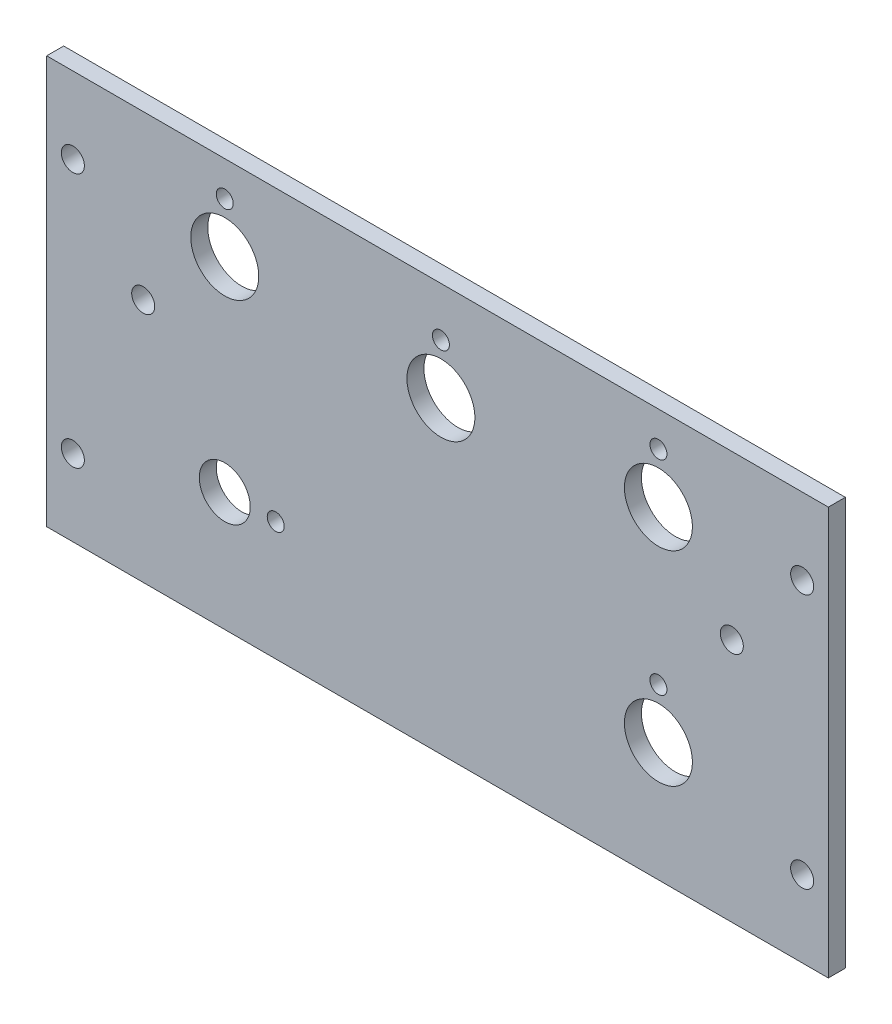
ISO-10303-21;
HEADER;
FILE_DESCRIPTION(('STEP AP214'),'2;1');
FILE_NAME('part.step','',(''),(''),'','','');
FILE_SCHEMA(('AUTOMOTIVE_DESIGN { 1 0 10303 214 1 1 1 1 }'));
ENDSEC;
DATA;
#1=APPLICATION_CONTEXT('core data for automotive mechanical design processes');
#2=APPLICATION_PROTOCOL_DEFINITION('international standard','automotive_design',2000,#1);
#3=PRODUCT_CONTEXT('',#1,'mechanical');
#4=PRODUCT('Part','Part','',(#3));
#5=PRODUCT_RELATED_PRODUCT_CATEGORY('part','',(#4));
#6=PRODUCT_DEFINITION_FORMATION('','',#4);
#7=PRODUCT_DEFINITION_CONTEXT('part definition',#1,'design');
#8=PRODUCT_DEFINITION('design','',#6,#7);
#9=PRODUCT_DEFINITION_SHAPE('','',#8);
#10=(LENGTH_UNIT() NAMED_UNIT(*) SI_UNIT(.MILLI.,.METRE.));
#11=(NAMED_UNIT(*) PLANE_ANGLE_UNIT() SI_UNIT($,.RADIAN.));
#12=(NAMED_UNIT(*) SI_UNIT($,.STERADIAN.) SOLID_ANGLE_UNIT());
#13=UNCERTAINTY_MEASURE_WITH_UNIT(LENGTH_MEASURE(1.E-05),#10,'distance_accuracy_value','');
#14=(GEOMETRIC_REPRESENTATION_CONTEXT(3) GLOBAL_UNCERTAINTY_ASSIGNED_CONTEXT((#13)) GLOBAL_UNIT_ASSIGNED_CONTEXT((#10,
#11,#12)) REPRESENTATION_CONTEXT('',''));
#15=CARTESIAN_POINT('',(0.,0.,0.));
#16=DIRECTION('',(0.,0.,1.));
#17=DIRECTION('',(1.,0.,0.));
#18=AXIS2_PLACEMENT_3D('',#15,#16,#17);
#19=CARTESIAN_POINT('',(0.,0.,-3.175));
#20=DIRECTION('',(1.,0.,0.));
#21=DIRECTION('',(0.,1.,0.));
#22=AXIS2_PLACEMENT_3D('',#19,#20,#21);
#23=PLANE('',#22);
#24=DIRECTION('',(0.,1.,0.));
#25=VECTOR('',#24,1.);
#26=CARTESIAN_POINT('',(0.,0.,0.));
#27=LINE('',#26,#25);
#28=CARTESIAN_POINT('',(0.,0.,0.));
#29=VERTEX_POINT('',#28);
#30=CARTESIAN_POINT('',(0.,76.2,0.));
#31=VERTEX_POINT('',#30);
#32=EDGE_CURVE('E104',#29,#31,#27,.T.);
#33=ORIENTED_EDGE('',*,*,#32,.F.);
#34=DIRECTION('',(0.,0.,1.));
#35=VECTOR('',#34,1.);
#36=CARTESIAN_POINT('',(0.,0.,-3.175));
#37=LINE('',#36,#35);
#38=CARTESIAN_POINT('',(0.,0.,-3.175));
#39=VERTEX_POINT('',#38);
#40=EDGE_CURVE('E11',#39,#29,#37,.T.);
#41=ORIENTED_EDGE('',*,*,#40,.F.);
#42=DIRECTION('',(0.,1.,0.));
#43=VECTOR('',#42,1.);
#44=CARTESIAN_POINT('',(0.,0.,-3.175));
#45=LINE('',#44,#43);
#46=CARTESIAN_POINT('',(0.,76.2,-3.175));
#47=VERTEX_POINT('',#46);
#48=EDGE_CURVE('E97',#39,#47,#45,.T.);
#49=ORIENTED_EDGE('',*,*,#48,.T.);
#50=DIRECTION('',(0.,0.,1.));
#51=VECTOR('',#50,1.);
#52=CARTESIAN_POINT('',(0.,76.2,-3.175));
#53=LINE('',#52,#51);
#54=EDGE_CURVE('E42',#47,#31,#53,.T.);
#55=ORIENTED_EDGE('',*,*,#54,.T.);
#56=EDGE_LOOP('',(#33,#41,#49,#55));
#57=FACE_BOUND('',#56,.T.);
#58=ADVANCED_FACE('F39',(#57),#23,.T.);
#59=CARTESIAN_POINT('',(-146.05,0.,-3.175));
#60=DIRECTION('',(0.,-1.,0.));
#61=DIRECTION('',(1.,0.,0.));
#62=AXIS2_PLACEMENT_3D('',#59,#60,#61);
#63=PLANE('',#62);
#64=DIRECTION('',(1.,0.,0.));
#65=VECTOR('',#64,1.);
#66=CARTESIAN_POINT('',(-146.05,0.,0.));
#67=LINE('',#66,#65);
#68=CARTESIAN_POINT('',(-146.05,0.,0.));
#69=VERTEX_POINT('',#68);
#70=EDGE_CURVE('E99',#69,#29,#67,.T.);
#71=ORIENTED_EDGE('',*,*,#70,.F.);
#72=DIRECTION('',(0.,0.,1.));
#73=VECTOR('',#72,1.);
#74=CARTESIAN_POINT('',(-146.05,0.,-3.175));
#75=LINE('',#74,#73);
#76=CARTESIAN_POINT('',(-146.05,0.,-3.175));
#77=VERTEX_POINT('',#76);
#78=EDGE_CURVE('E48',#77,#69,#75,.T.);
#79=ORIENTED_EDGE('',*,*,#78,.F.);
#80=DIRECTION('',(1.,0.,0.));
#81=VECTOR('',#80,1.);
#82=CARTESIAN_POINT('',(-146.05,0.,-3.175));
#83=LINE('',#82,#81);
#84=EDGE_CURVE('E94',#77,#39,#83,.T.);
#85=ORIENTED_EDGE('',*,*,#84,.T.);
#86=ORIENTED_EDGE('',*,*,#40,.T.);
#87=EDGE_LOOP('',(#71,#79,#85,#86));
#88=FACE_BOUND('',#87,.T.);
#89=ADVANCED_FACE('F115',(#88),#63,.T.);
#90=CARTESIAN_POINT('',(-146.05,76.2,-3.175));
#91=DIRECTION('',(-1.,0.,0.));
#92=DIRECTION('',(0.,0.,1.));
#93=AXIS2_PLACEMENT_3D('',#90,#91,#92);
#94=PLANE('',#93);
#95=DIRECTION('',(0.,-1.,0.));
#96=VECTOR('',#95,1.);
#97=CARTESIAN_POINT('',(-146.05,76.2,0.));
#98=LINE('',#97,#96);
#99=CARTESIAN_POINT('',(-146.05,76.2,0.));
#100=VERTEX_POINT('',#99);
#101=EDGE_CURVE('E89',#100,#69,#98,.T.);
#102=ORIENTED_EDGE('',*,*,#101,.F.);
#103=DIRECTION('',(0.,0.,1.));
#104=VECTOR('',#103,1.);
#105=CARTESIAN_POINT('',(-146.05,76.2,-3.175));
#106=LINE('',#105,#104);
#107=CARTESIAN_POINT('',(-146.05,76.2,-3.175));
#108=VERTEX_POINT('',#107);
#109=EDGE_CURVE('E84',#108,#100,#106,.T.);
#110=ORIENTED_EDGE('',*,*,#109,.F.);
#111=DIRECTION('',(0.,-1.,0.));
#112=VECTOR('',#111,1.);
#113=CARTESIAN_POINT('',(-146.05,76.2,-3.175));
#114=LINE('',#113,#112);
#115=EDGE_CURVE('E87',#108,#77,#114,.T.);
#116=ORIENTED_EDGE('',*,*,#115,.T.);
#117=ORIENTED_EDGE('',*,*,#78,.T.);
#118=EDGE_LOOP('',(#102,#110,#116,#117));
#119=FACE_BOUND('',#118,.T.);
#120=ADVANCED_FACE('F86',(#119),#94,.T.);
#121=CARTESIAN_POINT('',(0.,76.2,-3.175));
#122=DIRECTION('',(0.,1.,0.));
#123=DIRECTION('',(-1.,0.,0.));
#124=AXIS2_PLACEMENT_3D('',#121,#122,#123);
#125=PLANE('',#124);
#126=DIRECTION('',(-1.,0.,0.));
#127=VECTOR('',#126,1.);
#128=CARTESIAN_POINT('',(0.,76.2,0.));
#129=LINE('',#128,#127);
#130=EDGE_CURVE('E107',#31,#100,#129,.T.);
#131=ORIENTED_EDGE('',*,*,#130,.F.);
#132=ORIENTED_EDGE('',*,*,#54,.F.);
#133=DIRECTION('',(-1.,0.,0.));
#134=VECTOR('',#133,1.);
#135=CARTESIAN_POINT('',(0.,76.2,-3.175));
#136=LINE('',#135,#134);
#137=EDGE_CURVE('E93',#47,#108,#136,.T.);
#138=ORIENTED_EDGE('',*,*,#137,.T.);
#139=ORIENTED_EDGE('',*,*,#109,.T.);
#140=EDGE_LOOP('',(#131,#132,#138,#139));
#141=FACE_BOUND('',#140,.T.);
#142=ADVANCED_FACE('F96',(#141),#125,.T.);
#143=CARTESIAN_POINT('',(0.,0.,-3.175));
#144=DIRECTION('',(0.,0.,1.));
#145=DIRECTION('',(1.,0.,0.));
#146=AXIS2_PLACEMENT_3D('',#143,#144,#145);
#147=PLANE('',#146);
#148=CARTESIAN_POINT('',(-31.75,69.6994920669714,-3.175));
#149=DIRECTION('',(0.,0.,-1.));
#150=DIRECTION('',(-1.,0.,0.));
#151=AXIS2_PLACEMENT_3D('',#148,#149,#150);
#152=CIRCLE('',#151,1.5875);
#153=CARTESIAN_POINT('',(-33.3375,69.6994920669714,-3.175));
#154=VERTEX_POINT('',#153);
#155=EDGE_CURVE('E207',#154,#154,#152,.T.);
#156=ORIENTED_EDGE('',*,*,#155,.F.);
#157=EDGE_LOOP('',(#156));
#158=FACE_BOUND('',#157,.T.);
#159=CARTESIAN_POINT('',(-112.776,69.6994920669714,-3.175));
#160=DIRECTION('',(0.,0.,-1.));
#161=DIRECTION('',(-1.,0.,0.));
#162=AXIS2_PLACEMENT_3D('',#159,#160,#161);
#163=CIRCLE('',#162,1.58749999999999);
#164=CARTESIAN_POINT('',(-114.3635,69.6994920669714,-3.175));
#165=VERTEX_POINT('',#164);
#166=EDGE_CURVE('E209',#165,#165,#163,.T.);
#167=ORIENTED_EDGE('',*,*,#166,.F.);
#168=EDGE_LOOP('',(#167));
#169=FACE_BOUND('',#168,.T.);
#170=CARTESIAN_POINT('',(-103.251,22.225,-3.175));
#171=DIRECTION('',(0.,0.,-1.));
#172=DIRECTION('',(-1.,0.,0.));
#173=AXIS2_PLACEMENT_3D('',#170,#171,#172);
#174=CIRCLE('',#173,1.58749999999999);
#175=CARTESIAN_POINT('',(-104.8385,22.225,-3.175));
#176=VERTEX_POINT('',#175);
#177=EDGE_CURVE('E217',#176,#176,#174,.T.);
#178=ORIENTED_EDGE('',*,*,#177,.F.);
#179=EDGE_LOOP('',(#178));
#180=FACE_BOUND('',#179,.T.);
#181=CARTESIAN_POINT('',(-72.39,67.0324920669714,-3.175));
#182=DIRECTION('',(0.,0.,-1.));
#183=DIRECTION('',(-1.,0.,0.));
#184=AXIS2_PLACEMENT_3D('',#181,#182,#183);
#185=CIRCLE('',#184,1.58749999999999);
#186=CARTESIAN_POINT('',(-73.9775,67.0324920669714,-3.175));
#187=VERTEX_POINT('',#186);
#188=EDGE_CURVE('E223',#187,#187,#185,.T.);
#189=ORIENTED_EDGE('',*,*,#188,.F.);
#190=EDGE_LOOP('',(#189));
#191=FACE_BOUND('',#190,.T.);
#192=CARTESIAN_POINT('',(-31.75,31.5994920669714,-3.175));
#193=DIRECTION('',(0.,0.,-1.));
#194=DIRECTION('',(-1.,0.,0.));
#195=AXIS2_PLACEMENT_3D('',#192,#193,#194);
#196=CIRCLE('',#195,1.5875);
#197=CARTESIAN_POINT('',(-33.3375,31.5994920669714,-3.175));
#198=VERTEX_POINT('',#197);
#199=EDGE_CURVE('E229',#198,#198,#196,.T.);
#200=ORIENTED_EDGE('',*,*,#199,.F.);
#201=EDGE_LOOP('',(#200));
#202=FACE_BOUND('',#201,.T.);
#203=CARTESIAN_POINT('',(-31.75,60.325,-3.175));
#204=DIRECTION('',(0.,0.,-1.));
#205=DIRECTION('',(-1.,0.,0.));
#206=AXIS2_PLACEMENT_3D('',#203,#204,#205);
#207=CIRCLE('',#206,6.35);
#208=CARTESIAN_POINT('',(-38.1,60.325,-3.175));
#209=VERTEX_POINT('',#208);
#210=EDGE_CURVE('E235',#209,#209,#207,.T.);
#211=ORIENTED_EDGE('',*,*,#210,.F.);
#212=EDGE_LOOP('',(#211));
#213=FACE_BOUND('',#212,.T.);
#214=CARTESIAN_POINT('',(-72.39,57.658,-3.175));
#215=DIRECTION('',(0.,0.,-1.));
#216=DIRECTION('',(-1.,0.,0.));
#217=AXIS2_PLACEMENT_3D('',#214,#215,#216);
#218=CIRCLE('',#217,6.34999999999999);
#219=CARTESIAN_POINT('',(-78.74,57.658,-3.175));
#220=VERTEX_POINT('',#219);
#221=EDGE_CURVE('E241',#220,#220,#218,.T.);
#222=ORIENTED_EDGE('',*,*,#221,.F.);
#223=EDGE_LOOP('',(#222));
#224=FACE_BOUND('',#223,.T.);
#225=CARTESIAN_POINT('',(-112.776,60.325,-3.175));
#226=DIRECTION('',(0.,0.,-1.));
#227=DIRECTION('',(-1.,0.,0.));
#228=AXIS2_PLACEMENT_3D('',#225,#226,#227);
#229=CIRCLE('',#228,6.34999999999999);
#230=CARTESIAN_POINT('',(-119.126,60.325,-3.175));
#231=VERTEX_POINT('',#230);
#232=EDGE_CURVE('E247',#231,#231,#229,.T.);
#233=ORIENTED_EDGE('',*,*,#232,.F.);
#234=EDGE_LOOP('',(#233));
#235=FACE_BOUND('',#234,.T.);
#236=CARTESIAN_POINT('',(-31.75,22.225,-3.175));
#237=DIRECTION('',(0.,0.,-1.));
#238=DIRECTION('',(-1.,0.,0.));
#239=AXIS2_PLACEMENT_3D('',#236,#237,#238);
#240=CIRCLE('',#239,6.35);
#241=CARTESIAN_POINT('',(-38.1,22.225,-3.175));
#242=VERTEX_POINT('',#241);
#243=EDGE_CURVE('E253',#242,#242,#240,.T.);
#244=ORIENTED_EDGE('',*,*,#243,.F.);
#245=EDGE_LOOP('',(#244));
#246=FACE_BOUND('',#245,.T.);
#247=CARTESIAN_POINT('',(-112.776,22.225,-3.175));
#248=DIRECTION('',(0.,0.,-1.));
#249=DIRECTION('',(-1.,0.,0.));
#250=AXIS2_PLACEMENT_3D('',#247,#248,#249);
#251=CIRCLE('',#250,4.7625);
#252=CARTESIAN_POINT('',(-117.5385,22.225,-3.175));
#253=VERTEX_POINT('',#252);
#254=EDGE_CURVE('E259',#253,#253,#251,.T.);
#255=ORIENTED_EDGE('',*,*,#254,.F.);
#256=EDGE_LOOP('',(#255));
#257=FACE_BOUND('',#256,.T.);
#258=CARTESIAN_POINT('',(-4.88949999999997,61.9125,-3.175));
#259=DIRECTION('',(0.,0.,-1.));
#260=DIRECTION('',(-1.,0.,0.));
#261=AXIS2_PLACEMENT_3D('',#258,#259,#260);
#262=CIRCLE('',#261,2.15264999999999);
#263=CARTESIAN_POINT('',(-7.04214999999996,61.9125,-3.175));
#264=VERTEX_POINT('',#263);
#265=EDGE_CURVE('E265',#264,#264,#262,.T.);
#266=ORIENTED_EDGE('',*,*,#265,.F.);
#267=EDGE_LOOP('',(#266));
#268=FACE_BOUND('',#267,.T.);
#269=CARTESIAN_POINT('',(-4.88949999999995,14.2875,-3.175));
#270=DIRECTION('',(0.,0.,-1.));
#271=DIRECTION('',(-1.,0.,0.));
#272=AXIS2_PLACEMENT_3D('',#269,#270,#271);
#273=CIRCLE('',#272,2.15264999999999);
#274=CARTESIAN_POINT('',(-7.04214999999994,14.2875,-3.175));
#275=VERTEX_POINT('',#274);
#276=EDGE_CURVE('E271',#275,#275,#273,.T.);
#277=ORIENTED_EDGE('',*,*,#276,.F.);
#278=EDGE_LOOP('',(#277));
#279=FACE_BOUND('',#278,.T.);
#280=CARTESIAN_POINT('',(-141.1605,14.2875,-3.175));
#281=DIRECTION('',(0.,0.,-1.));
#282=DIRECTION('',(-1.,0.,0.));
#283=AXIS2_PLACEMENT_3D('',#280,#281,#282);
#284=CIRCLE('',#283,2.15264999999998);
#285=CARTESIAN_POINT('',(-143.31315,14.2875,-3.175));
#286=VERTEX_POINT('',#285);
#287=EDGE_CURVE('E277',#286,#286,#284,.T.);
#288=ORIENTED_EDGE('',*,*,#287,.F.);
#289=EDGE_LOOP('',(#288));
#290=FACE_BOUND('',#289,.T.);
#291=CARTESIAN_POINT('',(-141.1605,61.9125,-3.175));
#292=DIRECTION('',(0.,0.,-1.));
#293=DIRECTION('',(-1.,0.,0.));
#294=AXIS2_PLACEMENT_3D('',#291,#292,#293);
#295=CIRCLE('',#294,2.15264999999998);
#296=CARTESIAN_POINT('',(-143.31315,61.9125,-3.175));
#297=VERTEX_POINT('',#296);
#298=EDGE_CURVE('E283',#297,#297,#295,.T.);
#299=ORIENTED_EDGE('',*,*,#298,.F.);
#300=EDGE_LOOP('',(#299));
#301=FACE_BOUND('',#300,.T.);
#302=CARTESIAN_POINT('',(-128.016,45.72,-3.175));
#303=DIRECTION('',(0.,0.,-1.));
#304=DIRECTION('',(-1.,0.,0.));
#305=AXIS2_PLACEMENT_3D('',#302,#303,#304);
#306=CIRCLE('',#305,2.15264999999998);
#307=CARTESIAN_POINT('',(-130.16865,45.72,-3.175));
#308=VERTEX_POINT('',#307);
#309=EDGE_CURVE('E289',#308,#308,#306,.T.);
#310=ORIENTED_EDGE('',*,*,#309,.F.);
#311=EDGE_LOOP('',(#310));
#312=FACE_BOUND('',#311,.T.);
#313=CARTESIAN_POINT('',(-18.034,45.72,-3.175));
#314=DIRECTION('',(0.,0.,-1.));
#315=DIRECTION('',(-1.,0.,0.));
#316=AXIS2_PLACEMENT_3D('',#313,#314,#315);
#317=CIRCLE('',#316,2.15264999999999);
#318=CARTESIAN_POINT('',(-20.18665,45.72,-3.175));
#319=VERTEX_POINT('',#318);
#320=EDGE_CURVE('E295',#319,#319,#317,.T.);
#321=ORIENTED_EDGE('',*,*,#320,.F.);
#322=EDGE_LOOP('',(#321));
#323=FACE_BOUND('',#322,.T.);
#324=ORIENTED_EDGE('',*,*,#48,.F.);
#325=ORIENTED_EDGE('',*,*,#84,.F.);
#326=ORIENTED_EDGE('',*,*,#115,.F.);
#327=ORIENTED_EDGE('',*,*,#137,.F.);
#328=EDGE_LOOP('',(#324,#325,#326,#327));
#329=FACE_BOUND('',#328,.T.);
#330=ADVANCED_FACE('F92',(#158,#169,#180,#191,#202,#213,#224,#235,#246,#257,#268,#279,#290,#301,
#312,#323,#329),#147,.F.);
#331=CARTESIAN_POINT('',(0.,0.,0.));
#332=DIRECTION('',(0.,0.,1.));
#333=DIRECTION('',(1.,0.,0.));
#334=AXIS2_PLACEMENT_3D('',#331,#332,#333);
#335=PLANE('',#334);
#336=CARTESIAN_POINT('',(-31.75,69.6994920669714,0.));
#337=DIRECTION('',(0.,0.,-1.));
#338=DIRECTION('',(-1.,0.,0.));
#339=AXIS2_PLACEMENT_3D('',#336,#337,#338);
#340=CIRCLE('',#339,1.5875);
#341=CARTESIAN_POINT('',(-33.3375,69.6994920669714,0.));
#342=VERTEX_POINT('',#341);
#343=EDGE_CURVE('E205',#342,#342,#340,.T.);
#344=ORIENTED_EDGE('',*,*,#343,.T.);
#345=EDGE_LOOP('',(#344));
#346=FACE_BOUND('',#345,.T.);
#347=CARTESIAN_POINT('',(-112.776,69.6994920669714,0.));
#348=DIRECTION('',(0.,0.,-1.));
#349=DIRECTION('',(-1.,0.,0.));
#350=AXIS2_PLACEMENT_3D('',#347,#348,#349);
#351=CIRCLE('',#350,1.58750000000001);
#352=CARTESIAN_POINT('',(-114.3635,69.6994920669714,0.));
#353=VERTEX_POINT('',#352);
#354=EDGE_CURVE('E214',#353,#353,#351,.T.);
#355=ORIENTED_EDGE('',*,*,#354,.T.);
#356=EDGE_LOOP('',(#355));
#357=FACE_BOUND('',#356,.T.);
#358=CARTESIAN_POINT('',(-103.251,22.225,0.));
#359=DIRECTION('',(0.,0.,-1.));
#360=DIRECTION('',(-1.,0.,0.));
#361=AXIS2_PLACEMENT_3D('',#358,#359,#360);
#362=CIRCLE('',#361,1.58750000000001);
#363=CARTESIAN_POINT('',(-104.8385,22.225,0.));
#364=VERTEX_POINT('',#363);
#365=EDGE_CURVE('E220',#364,#364,#362,.T.);
#366=ORIENTED_EDGE('',*,*,#365,.T.);
#367=EDGE_LOOP('',(#366));
#368=FACE_BOUND('',#367,.T.);
#369=CARTESIAN_POINT('',(-72.39,67.0324920669714,0.));
#370=DIRECTION('',(0.,0.,-1.));
#371=DIRECTION('',(-1.,0.,0.));
#372=AXIS2_PLACEMENT_3D('',#369,#370,#371);
#373=CIRCLE('',#372,1.58750000000001);
#374=CARTESIAN_POINT('',(-73.9775,67.0324920669714,0.));
#375=VERTEX_POINT('',#374);
#376=EDGE_CURVE('E226',#375,#375,#373,.T.);
#377=ORIENTED_EDGE('',*,*,#376,.T.);
#378=EDGE_LOOP('',(#377));
#379=FACE_BOUND('',#378,.T.);
#380=CARTESIAN_POINT('',(-31.75,31.5994920669714,0.));
#381=DIRECTION('',(0.,0.,-1.));
#382=DIRECTION('',(-1.,0.,0.));
#383=AXIS2_PLACEMENT_3D('',#380,#381,#382);
#384=CIRCLE('',#383,1.5875);
#385=CARTESIAN_POINT('',(-33.3375,31.5994920669714,0.));
#386=VERTEX_POINT('',#385);
#387=EDGE_CURVE('E232',#386,#386,#384,.T.);
#388=ORIENTED_EDGE('',*,*,#387,.T.);
#389=EDGE_LOOP('',(#388));
#390=FACE_BOUND('',#389,.T.);
#391=CARTESIAN_POINT('',(-31.75,60.325,0.));
#392=DIRECTION('',(0.,0.,-1.));
#393=DIRECTION('',(-1.,0.,0.));
#394=AXIS2_PLACEMENT_3D('',#391,#392,#393);
#395=CIRCLE('',#394,6.35);
#396=CARTESIAN_POINT('',(-38.1,60.325,0.));
#397=VERTEX_POINT('',#396);
#398=EDGE_CURVE('E238',#397,#397,#395,.T.);
#399=ORIENTED_EDGE('',*,*,#398,.T.);
#400=EDGE_LOOP('',(#399));
#401=FACE_BOUND('',#400,.T.);
#402=CARTESIAN_POINT('',(-72.39,57.658,0.));
#403=DIRECTION('',(0.,0.,-1.));
#404=DIRECTION('',(-1.,0.,0.));
#405=AXIS2_PLACEMENT_3D('',#402,#403,#404);
#406=CIRCLE('',#405,6.34999999999999);
#407=CARTESIAN_POINT('',(-78.74,57.658,0.));
#408=VERTEX_POINT('',#407);
#409=EDGE_CURVE('E244',#408,#408,#406,.T.);
#410=ORIENTED_EDGE('',*,*,#409,.T.);
#411=EDGE_LOOP('',(#410));
#412=FACE_BOUND('',#411,.T.);
#413=CARTESIAN_POINT('',(-112.776,60.325,0.));
#414=DIRECTION('',(0.,0.,-1.));
#415=DIRECTION('',(-1.,0.,0.));
#416=AXIS2_PLACEMENT_3D('',#413,#414,#415);
#417=CIRCLE('',#416,6.34999999999999);
#418=CARTESIAN_POINT('',(-119.126,60.325,0.));
#419=VERTEX_POINT('',#418);
#420=EDGE_CURVE('E250',#419,#419,#417,.T.);
#421=ORIENTED_EDGE('',*,*,#420,.T.);
#422=EDGE_LOOP('',(#421));
#423=FACE_BOUND('',#422,.T.);
#424=CARTESIAN_POINT('',(-31.75,22.225,0.));
#425=DIRECTION('',(0.,0.,-1.));
#426=DIRECTION('',(-1.,0.,0.));
#427=AXIS2_PLACEMENT_3D('',#424,#425,#426);
#428=CIRCLE('',#427,6.35);
#429=CARTESIAN_POINT('',(-38.1,22.225,0.));
#430=VERTEX_POINT('',#429);
#431=EDGE_CURVE('E256',#430,#430,#428,.T.);
#432=ORIENTED_EDGE('',*,*,#431,.T.);
#433=EDGE_LOOP('',(#432));
#434=FACE_BOUND('',#433,.T.);
#435=CARTESIAN_POINT('',(-112.776,22.225,0.));
#436=DIRECTION('',(0.,0.,-1.));
#437=DIRECTION('',(-1.,0.,0.));
#438=AXIS2_PLACEMENT_3D('',#435,#436,#437);
#439=CIRCLE('',#438,4.7625);
#440=CARTESIAN_POINT('',(-117.5385,22.225,0.));
#441=VERTEX_POINT('',#440);
#442=EDGE_CURVE('E262',#441,#441,#439,.T.);
#443=ORIENTED_EDGE('',*,*,#442,.T.);
#444=EDGE_LOOP('',(#443));
#445=FACE_BOUND('',#444,.T.);
#446=CARTESIAN_POINT('',(-4.88949999999997,61.9125,0.));
#447=DIRECTION('',(0.,0.,-1.));
#448=DIRECTION('',(-1.,0.,0.));
#449=AXIS2_PLACEMENT_3D('',#446,#447,#448);
#450=CIRCLE('',#449,2.15265);
#451=CARTESIAN_POINT('',(-7.04214999999997,61.9125,0.));
#452=VERTEX_POINT('',#451);
#453=EDGE_CURVE('E268',#452,#452,#450,.T.);
#454=ORIENTED_EDGE('',*,*,#453,.T.);
#455=EDGE_LOOP('',(#454));
#456=FACE_BOUND('',#455,.T.);
#457=CARTESIAN_POINT('',(-4.88949999999995,14.2875,0.));
#458=DIRECTION('',(0.,0.,-1.));
#459=DIRECTION('',(-1.,0.,0.));
#460=AXIS2_PLACEMENT_3D('',#457,#458,#459);
#461=CIRCLE('',#460,2.15265);
#462=CARTESIAN_POINT('',(-7.04214999999995,14.2875,0.));
#463=VERTEX_POINT('',#462);
#464=EDGE_CURVE('E274',#463,#463,#461,.T.);
#465=ORIENTED_EDGE('',*,*,#464,.T.);
#466=EDGE_LOOP('',(#465));
#467=FACE_BOUND('',#466,.T.);
#468=CARTESIAN_POINT('',(-141.1605,14.2875,0.));
#469=DIRECTION('',(0.,0.,-1.));
#470=DIRECTION('',(-1.,0.,0.));
#471=AXIS2_PLACEMENT_3D('',#468,#469,#470);
#472=CIRCLE('',#471,2.15265000000001);
#473=CARTESIAN_POINT('',(-143.31315,14.2875,0.));
#474=VERTEX_POINT('',#473);
#475=EDGE_CURVE('E280',#474,#474,#472,.T.);
#476=ORIENTED_EDGE('',*,*,#475,.T.);
#477=EDGE_LOOP('',(#476));
#478=FACE_BOUND('',#477,.T.);
#479=CARTESIAN_POINT('',(-141.1605,61.9125,0.));
#480=DIRECTION('',(0.,0.,-1.));
#481=DIRECTION('',(-1.,0.,0.));
#482=AXIS2_PLACEMENT_3D('',#479,#480,#481);
#483=CIRCLE('',#482,2.15265000000001);
#484=CARTESIAN_POINT('',(-143.31315,61.9125,0.));
#485=VERTEX_POINT('',#484);
#486=EDGE_CURVE('E286',#485,#485,#483,.T.);
#487=ORIENTED_EDGE('',*,*,#486,.T.);
#488=EDGE_LOOP('',(#487));
#489=FACE_BOUND('',#488,.T.);
#490=CARTESIAN_POINT('',(-128.016,45.72,0.));
#491=DIRECTION('',(0.,0.,-1.));
#492=DIRECTION('',(-1.,0.,0.));
#493=AXIS2_PLACEMENT_3D('',#490,#491,#492);
#494=CIRCLE('',#493,2.15265000000001);
#495=CARTESIAN_POINT('',(-130.16865,45.72,0.));
#496=VERTEX_POINT('',#495);
#497=EDGE_CURVE('E292',#496,#496,#494,.T.);
#498=ORIENTED_EDGE('',*,*,#497,.T.);
#499=EDGE_LOOP('',(#498));
#500=FACE_BOUND('',#499,.T.);
#501=CARTESIAN_POINT('',(-18.034,45.72,0.));
#502=DIRECTION('',(0.,0.,-1.));
#503=DIRECTION('',(-1.,0.,0.));
#504=AXIS2_PLACEMENT_3D('',#501,#502,#503);
#505=CIRCLE('',#504,2.15265);
#506=CARTESIAN_POINT('',(-20.18665,45.72,0.));
#507=VERTEX_POINT('',#506);
#508=EDGE_CURVE('E108',#507,#507,#505,.T.);
#509=ORIENTED_EDGE('',*,*,#508,.T.);
#510=EDGE_LOOP('',(#509));
#511=FACE_BOUND('',#510,.T.);
#512=ORIENTED_EDGE('',*,*,#32,.T.);
#513=ORIENTED_EDGE('',*,*,#130,.T.);
#514=ORIENTED_EDGE('',*,*,#101,.T.);
#515=ORIENTED_EDGE('',*,*,#70,.T.);
#516=EDGE_LOOP('',(#512,#513,#514,#515));
#517=FACE_BOUND('',#516,.T.);
#518=ADVANCED_FACE('F114',(#346,#357,#368,#379,#390,#401,#412,#423,#434,#445,#456,#467,#478,
#489,#500,#511,#517),#335,.T.);
#519=CARTESIAN_POINT('',(-18.034,45.72,-3.175));
#520=DIRECTION('',(0.,0.,-1.));
#521=DIRECTION('',(-1.,0.,0.));
#522=AXIS2_PLACEMENT_3D('',#519,#520,#521);
#523=CYLINDRICAL_SURFACE('',#522,2.15264999999999);
#524=ORIENTED_EDGE('',*,*,#508,.F.);
#525=EDGE_LOOP('',(#524));
#526=FACE_BOUND('',#525,.T.);
#527=ORIENTED_EDGE('',*,*,#320,.T.);
#528=EDGE_LOOP('',(#527));
#529=FACE_BOUND('',#528,.T.);
#530=ADVANCED_FACE('F133',(#526,#529),#523,.F.);
#531=CARTESIAN_POINT('',(-128.016,45.72,-3.175));
#532=DIRECTION('',(0.,0.,-1.));
#533=DIRECTION('',(-1.,0.,0.));
#534=AXIS2_PLACEMENT_3D('',#531,#532,#533);
#535=CYLINDRICAL_SURFACE('',#534,2.15264999999999);
#536=ORIENTED_EDGE('',*,*,#497,.F.);
#537=EDGE_LOOP('',(#536));
#538=FACE_BOUND('',#537,.T.);
#539=ORIENTED_EDGE('',*,*,#309,.T.);
#540=EDGE_LOOP('',(#539));
#541=FACE_BOUND('',#540,.T.);
#542=ADVANCED_FACE('F140',(#538,#541),#535,.F.);
#543=CARTESIAN_POINT('',(-141.1605,61.9125,-3.175));
#544=DIRECTION('',(0.,0.,-1.));
#545=DIRECTION('',(-1.,0.,0.));
#546=AXIS2_PLACEMENT_3D('',#543,#544,#545);
#547=CYLINDRICAL_SURFACE('',#546,2.15264999999999);
#548=ORIENTED_EDGE('',*,*,#486,.F.);
#549=EDGE_LOOP('',(#548));
#550=FACE_BOUND('',#549,.T.);
#551=ORIENTED_EDGE('',*,*,#298,.T.);
#552=EDGE_LOOP('',(#551));
#553=FACE_BOUND('',#552,.T.);
#554=ADVANCED_FACE('F144',(#550,#553),#547,.F.);
#555=CARTESIAN_POINT('',(-141.1605,14.2875,-3.175));
#556=DIRECTION('',(0.,0.,-1.));
#557=DIRECTION('',(-1.,0.,0.));
#558=AXIS2_PLACEMENT_3D('',#555,#556,#557);
#559=CYLINDRICAL_SURFACE('',#558,2.15264999999999);
#560=ORIENTED_EDGE('',*,*,#475,.F.);
#561=EDGE_LOOP('',(#560));
#562=FACE_BOUND('',#561,.T.);
#563=ORIENTED_EDGE('',*,*,#287,.T.);
#564=EDGE_LOOP('',(#563));
#565=FACE_BOUND('',#564,.T.);
#566=ADVANCED_FACE('F148',(#562,#565),#559,.F.);
#567=CARTESIAN_POINT('',(-4.88949999999995,14.2875,-3.175));
#568=DIRECTION('',(0.,0.,-1.));
#569=DIRECTION('',(-1.,0.,0.));
#570=AXIS2_PLACEMENT_3D('',#567,#568,#569);
#571=CYLINDRICAL_SURFACE('',#570,2.15264999999999);
#572=ORIENTED_EDGE('',*,*,#464,.F.);
#573=EDGE_LOOP('',(#572));
#574=FACE_BOUND('',#573,.T.);
#575=ORIENTED_EDGE('',*,*,#276,.T.);
#576=EDGE_LOOP('',(#575));
#577=FACE_BOUND('',#576,.T.);
#578=ADVANCED_FACE('F152',(#574,#577),#571,.F.);
#579=CARTESIAN_POINT('',(-4.88949999999997,61.9125,-3.175));
#580=DIRECTION('',(0.,0.,-1.));
#581=DIRECTION('',(-1.,0.,0.));
#582=AXIS2_PLACEMENT_3D('',#579,#580,#581);
#583=CYLINDRICAL_SURFACE('',#582,2.15264999999999);
#584=ORIENTED_EDGE('',*,*,#453,.F.);
#585=EDGE_LOOP('',(#584));
#586=FACE_BOUND('',#585,.T.);
#587=ORIENTED_EDGE('',*,*,#265,.T.);
#588=EDGE_LOOP('',(#587));
#589=FACE_BOUND('',#588,.T.);
#590=ADVANCED_FACE('F156',(#586,#589),#583,.F.);
#591=CARTESIAN_POINT('',(-112.776,22.225,-3.175));
#592=DIRECTION('',(0.,0.,-1.));
#593=DIRECTION('',(-1.,0.,0.));
#594=AXIS2_PLACEMENT_3D('',#591,#592,#593);
#595=CYLINDRICAL_SURFACE('',#594,4.7625);
#596=ORIENTED_EDGE('',*,*,#442,.F.);
#597=EDGE_LOOP('',(#596));
#598=FACE_BOUND('',#597,.T.);
#599=ORIENTED_EDGE('',*,*,#254,.T.);
#600=EDGE_LOOP('',(#599));
#601=FACE_BOUND('',#600,.T.);
#602=ADVANCED_FACE('F160',(#598,#601),#595,.F.);
#603=CARTESIAN_POINT('',(-31.75,22.225,-3.175));
#604=DIRECTION('',(0.,0.,-1.));
#605=DIRECTION('',(-1.,0.,0.));
#606=AXIS2_PLACEMENT_3D('',#603,#604,#605);
#607=CYLINDRICAL_SURFACE('',#606,6.35);
#608=ORIENTED_EDGE('',*,*,#431,.F.);
#609=EDGE_LOOP('',(#608));
#610=FACE_BOUND('',#609,.T.);
#611=ORIENTED_EDGE('',*,*,#243,.T.);
#612=EDGE_LOOP('',(#611));
#613=FACE_BOUND('',#612,.T.);
#614=ADVANCED_FACE('F164',(#610,#613),#607,.F.);
#615=CARTESIAN_POINT('',(-112.776,60.325,-3.175));
#616=DIRECTION('',(0.,0.,-1.));
#617=DIRECTION('',(-1.,0.,0.));
#618=AXIS2_PLACEMENT_3D('',#615,#616,#617);
#619=CYLINDRICAL_SURFACE('',#618,6.34999999999999);
#620=ORIENTED_EDGE('',*,*,#420,.F.);
#621=EDGE_LOOP('',(#620));
#622=FACE_BOUND('',#621,.T.);
#623=ORIENTED_EDGE('',*,*,#232,.T.);
#624=EDGE_LOOP('',(#623));
#625=FACE_BOUND('',#624,.T.);
#626=ADVANCED_FACE('F168',(#622,#625),#619,.F.);
#627=CARTESIAN_POINT('',(-72.39,57.658,-3.175));
#628=DIRECTION('',(0.,0.,-1.));
#629=DIRECTION('',(-1.,0.,0.));
#630=AXIS2_PLACEMENT_3D('',#627,#628,#629);
#631=CYLINDRICAL_SURFACE('',#630,6.34999999999999);
#632=ORIENTED_EDGE('',*,*,#409,.F.);
#633=EDGE_LOOP('',(#632));
#634=FACE_BOUND('',#633,.T.);
#635=ORIENTED_EDGE('',*,*,#221,.T.);
#636=EDGE_LOOP('',(#635));
#637=FACE_BOUND('',#636,.T.);
#638=ADVANCED_FACE('F172',(#634,#637),#631,.F.);
#639=CARTESIAN_POINT('',(-31.75,60.325,-3.175));
#640=DIRECTION('',(0.,0.,-1.));
#641=DIRECTION('',(-1.,0.,0.));
#642=AXIS2_PLACEMENT_3D('',#639,#640,#641);
#643=CYLINDRICAL_SURFACE('',#642,6.35);
#644=ORIENTED_EDGE('',*,*,#398,.F.);
#645=EDGE_LOOP('',(#644));
#646=FACE_BOUND('',#645,.T.);
#647=ORIENTED_EDGE('',*,*,#210,.T.);
#648=EDGE_LOOP('',(#647));
#649=FACE_BOUND('',#648,.T.);
#650=ADVANCED_FACE('F176',(#646,#649),#643,.F.);
#651=CARTESIAN_POINT('',(-31.75,31.5994920669714,-3.175));
#652=DIRECTION('',(0.,0.,-1.));
#653=DIRECTION('',(-1.,0.,0.));
#654=AXIS2_PLACEMENT_3D('',#651,#652,#653);
#655=CYLINDRICAL_SURFACE('',#654,1.5875);
#656=ORIENTED_EDGE('',*,*,#387,.F.);
#657=EDGE_LOOP('',(#656));
#658=FACE_BOUND('',#657,.T.);
#659=ORIENTED_EDGE('',*,*,#199,.T.);
#660=EDGE_LOOP('',(#659));
#661=FACE_BOUND('',#660,.T.);
#662=ADVANCED_FACE('F180',(#658,#661),#655,.F.);
#663=CARTESIAN_POINT('',(-72.39,67.0324920669714,-3.175));
#664=DIRECTION('',(0.,0.,-1.));
#665=DIRECTION('',(-1.,0.,0.));
#666=AXIS2_PLACEMENT_3D('',#663,#664,#665);
#667=CYLINDRICAL_SURFACE('',#666,1.5875);
#668=ORIENTED_EDGE('',*,*,#376,.F.);
#669=EDGE_LOOP('',(#668));
#670=FACE_BOUND('',#669,.T.);
#671=ORIENTED_EDGE('',*,*,#188,.T.);
#672=EDGE_LOOP('',(#671));
#673=FACE_BOUND('',#672,.T.);
#674=ADVANCED_FACE('F184',(#670,#673),#667,.F.);
#675=CARTESIAN_POINT('',(-103.251,22.225,-3.175));
#676=DIRECTION('',(0.,0.,-1.));
#677=DIRECTION('',(-1.,0.,0.));
#678=AXIS2_PLACEMENT_3D('',#675,#676,#677);
#679=CYLINDRICAL_SURFACE('',#678,1.5875);
#680=ORIENTED_EDGE('',*,*,#365,.F.);
#681=EDGE_LOOP('',(#680));
#682=FACE_BOUND('',#681,.T.);
#683=ORIENTED_EDGE('',*,*,#177,.T.);
#684=EDGE_LOOP('',(#683));
#685=FACE_BOUND('',#684,.T.);
#686=ADVANCED_FACE('F188',(#682,#685),#679,.F.);
#687=CARTESIAN_POINT('',(-112.776,69.6994920669714,-3.175));
#688=DIRECTION('',(0.,0.,-1.));
#689=DIRECTION('',(-1.,0.,0.));
#690=AXIS2_PLACEMENT_3D('',#687,#688,#689);
#691=CYLINDRICAL_SURFACE('',#690,1.5875);
#692=ORIENTED_EDGE('',*,*,#354,.F.);
#693=EDGE_LOOP('',(#692));
#694=FACE_BOUND('',#693,.T.);
#695=ORIENTED_EDGE('',*,*,#166,.T.);
#696=EDGE_LOOP('',(#695));
#697=FACE_BOUND('',#696,.T.);
#698=ADVANCED_FACE('F192',(#694,#697),#691,.F.);
#699=CARTESIAN_POINT('',(-31.75,69.6994920669714,-3.175));
#700=DIRECTION('',(0.,0.,-1.));
#701=DIRECTION('',(-1.,0.,0.));
#702=AXIS2_PLACEMENT_3D('',#699,#700,#701);
#703=CYLINDRICAL_SURFACE('',#702,1.5875);
#704=ORIENTED_EDGE('',*,*,#343,.F.);
#705=EDGE_LOOP('',(#704));
#706=FACE_BOUND('',#705,.T.);
#707=ORIENTED_EDGE('',*,*,#155,.T.);
#708=EDGE_LOOP('',(#707));
#709=FACE_BOUND('',#708,.T.);
#710=ADVANCED_FACE('F196',(#706,#709),#703,.F.);
#711=CLOSED_SHELL('',(#58,#89,#120,#142,#330,#518,#530,#542,#554,#566,#578,#590,#602,#614,#626,
#638,#650,#662,#674,#686,#698,#710));
#712=MANIFOLD_SOLID_BREP('B2',#711);
#713=ADVANCED_BREP_SHAPE_REPRESENTATION('',(#18,#712),#14);
#714=SHAPE_DEFINITION_REPRESENTATION(#9,#713);
ENDSEC;
END-ISO-10303-21;
